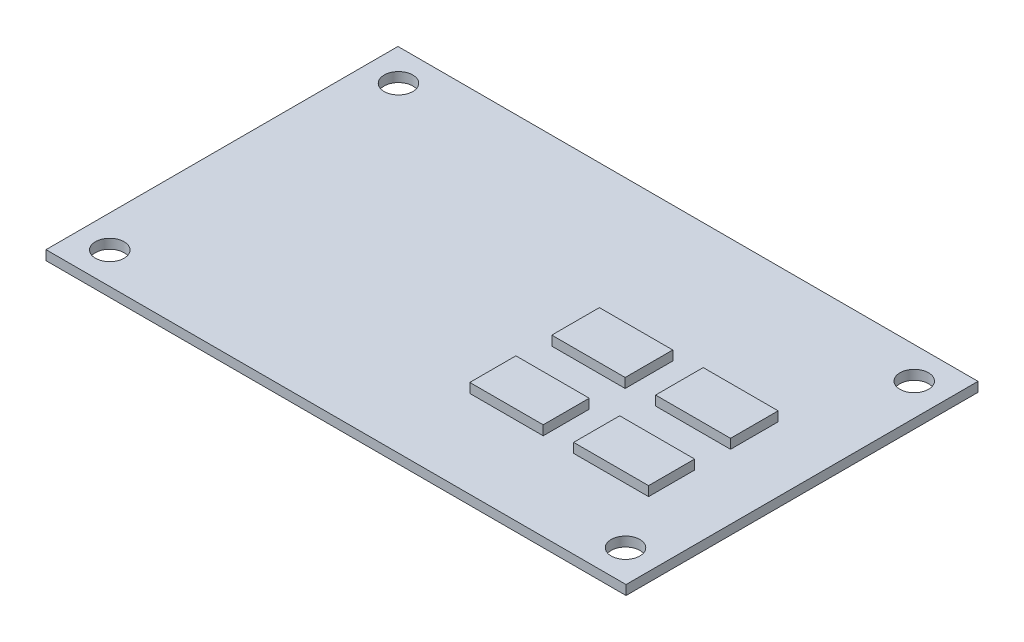
ISO-10303-21;
HEADER;
FILE_DESCRIPTION(('STEP AP214'),'2;1');
FILE_NAME('part.step','',(''),(''),'','','');
FILE_SCHEMA(('AUTOMOTIVE_DESIGN { 1 0 10303 214 1 1 1 1 }'));
ENDSEC;
DATA;
#1=APPLICATION_CONTEXT('core data for automotive mechanical design processes');
#2=APPLICATION_PROTOCOL_DEFINITION('international standard','automotive_design',2000,#1);
#3=PRODUCT_CONTEXT('',#1,'mechanical');
#4=PRODUCT('Part','Part','',(#3));
#5=PRODUCT_RELATED_PRODUCT_CATEGORY('part','',(#4));
#6=PRODUCT_DEFINITION_FORMATION('','',#4);
#7=PRODUCT_DEFINITION_CONTEXT('part definition',#1,'design');
#8=PRODUCT_DEFINITION('design','',#6,#7);
#9=PRODUCT_DEFINITION_SHAPE('','',#8);
#10=(LENGTH_UNIT() NAMED_UNIT(*) SI_UNIT(.MILLI.,.METRE.));
#11=(NAMED_UNIT(*) PLANE_ANGLE_UNIT() SI_UNIT($,.RADIAN.));
#12=(NAMED_UNIT(*) SI_UNIT($,.STERADIAN.) SOLID_ANGLE_UNIT());
#13=UNCERTAINTY_MEASURE_WITH_UNIT(LENGTH_MEASURE(1.E-05),#10,'distance_accuracy_value','');
#14=(GEOMETRIC_REPRESENTATION_CONTEXT(3) GLOBAL_UNCERTAINTY_ASSIGNED_CONTEXT((#13)) GLOBAL_UNIT_ASSIGNED_CONTEXT((#10,
#11,#12)) REPRESENTATION_CONTEXT('',''));
#15=CARTESIAN_POINT('',(0.,0.,0.));
#16=DIRECTION('',(0.,0.,1.));
#17=DIRECTION('',(1.,0.,0.));
#18=AXIS2_PLACEMENT_3D('',#15,#16,#17);
#19=CARTESIAN_POINT('',(0.,1.,0.));
#20=DIRECTION('',(0.,1.,0.));
#21=DIRECTION('',(0.,0.,1.));
#22=AXIS2_PLACEMENT_3D('',#19,#20,#21);
#23=PLANE('',#22);
#24=CARTESIAN_POINT('',(-27.,1.,-15.115));
#25=DIRECTION('',(0.,1.,0.));
#26=DIRECTION('',(0.,0.,1.));
#27=AXIS2_PLACEMENT_3D('',#24,#25,#26);
#28=CIRCLE('',#27,1.5);
#29=CARTESIAN_POINT('',(-27.,1.,-13.615));
#30=VERTEX_POINT('',#29);
#31=EDGE_CURVE('E288',#30,#30,#28,.T.);
#32=ORIENTED_EDGE('',*,*,#31,.F.);
#33=EDGE_LOOP('',(#32));
#34=FACE_BOUND('',#33,.T.);
#35=CARTESIAN_POINT('',(27.,1.,-15.115));
#36=DIRECTION('',(0.,1.,0.));
#37=DIRECTION('',(0.,0.,1.));
#38=AXIS2_PLACEMENT_3D('',#35,#36,#37);
#39=CIRCLE('',#38,1.5);
#40=CARTESIAN_POINT('',(27.,1.,-13.615));
#41=VERTEX_POINT('',#40);
#42=EDGE_CURVE('E291',#41,#41,#39,.T.);
#43=ORIENTED_EDGE('',*,*,#42,.F.);
#44=EDGE_LOOP('',(#43));
#45=FACE_BOUND('',#44,.T.);
#46=CARTESIAN_POINT('',(27.,1.,15.115));
#47=DIRECTION('',(0.,1.,0.));
#48=DIRECTION('',(0.,0.,1.));
#49=AXIS2_PLACEMENT_3D('',#46,#47,#48);
#50=CIRCLE('',#49,1.5);
#51=CARTESIAN_POINT('',(27.,1.,16.615));
#52=VERTEX_POINT('',#51);
#53=EDGE_CURVE('E297',#52,#52,#50,.T.);
#54=ORIENTED_EDGE('',*,*,#53,.F.);
#55=EDGE_LOOP('',(#54));
#56=FACE_BOUND('',#55,.T.);
#57=CARTESIAN_POINT('',(-27.,1.,15.115));
#58=DIRECTION('',(0.,1.,0.));
#59=DIRECTION('',(0.,0.,1.));
#60=AXIS2_PLACEMENT_3D('',#57,#58,#59);
#61=CIRCLE('',#60,1.5);
#62=CARTESIAN_POINT('',(-27.,1.,16.615));
#63=VERTEX_POINT('',#62);
#64=EDGE_CURVE('E301',#63,#63,#61,.T.);
#65=ORIENTED_EDGE('',*,*,#64,.F.);
#66=EDGE_LOOP('',(#65));
#67=FACE_BOUND('',#66,.T.);
#68=DIRECTION('',(0.,0.,-1.));
#69=VECTOR('',#68,1.);
#70=CARTESIAN_POINT('',(30.365,1.,-18.425));
#71=LINE('',#70,#69);
#72=CARTESIAN_POINT('',(30.365,1.,18.425));
#73=VERTEX_POINT('',#72);
#74=CARTESIAN_POINT('',(30.365,1.,-18.425));
#75=VERTEX_POINT('',#74);
#76=EDGE_CURVE('E308',#73,#75,#71,.T.);
#77=ORIENTED_EDGE('',*,*,#76,.T.);
#78=DIRECTION('',(-1.,0.,0.));
#79=VECTOR('',#78,1.);
#80=CARTESIAN_POINT('',(-30.365,1.,-18.425));
#81=LINE('',#80,#79);
#82=CARTESIAN_POINT('',(-30.365,1.,-18.425));
#83=VERTEX_POINT('',#82);
#84=EDGE_CURVE('E311',#75,#83,#81,.T.);
#85=ORIENTED_EDGE('',*,*,#84,.T.);
#86=DIRECTION('',(0.,0.,1.));
#87=VECTOR('',#86,1.);
#88=CARTESIAN_POINT('',(-30.365,1.,-18.425));
#89=LINE('',#88,#87);
#90=CARTESIAN_POINT('',(-30.365,1.,18.425));
#91=VERTEX_POINT('',#90);
#92=EDGE_CURVE('E314',#83,#91,#89,.T.);
#93=ORIENTED_EDGE('',*,*,#92,.T.);
#94=DIRECTION('',(1.,0.,0.));
#95=VECTOR('',#94,1.);
#96=CARTESIAN_POINT('',(-30.365,1.,18.425));
#97=LINE('',#96,#95);
#98=EDGE_CURVE('E316',#91,#73,#97,.T.);
#99=ORIENTED_EDGE('',*,*,#98,.T.);
#100=EDGE_LOOP('',(#77,#85,#93,#99));
#101=FACE_BOUND('',#100,.T.);
#102=DIRECTION('',(1.,0.,0.));
#103=VECTOR('',#102,1.);
#104=CARTESIAN_POINT('',(4.86128004171232,1.,0.69638328456207));
#105=LINE('',#104,#103);
#106=CARTESIAN_POINT('',(4.86128004171232,1.,0.69638328456207));
#107=VERTEX_POINT('',#106);
#108=CARTESIAN_POINT('',(12.5431113991219,1.,0.69638328456207));
#109=VERTEX_POINT('',#108);
#110=EDGE_CURVE('E273',#107,#109,#105,.T.);
#111=ORIENTED_EDGE('',*,*,#110,.F.);
#112=DIRECTION('',(0.,0.,1.));
#113=VECTOR('',#112,1.);
#114=CARTESIAN_POINT('',(4.86128004171232,1.,-4.28863493673567));
#115=LINE('',#114,#113);
#116=CARTESIAN_POINT('',(4.86128004171232,1.,-4.28863493673567));
#117=VERTEX_POINT('',#116);
#118=EDGE_CURVE('E259',#117,#107,#115,.T.);
#119=ORIENTED_EDGE('',*,*,#118,.F.);
#120=DIRECTION('',(-1.,0.,0.));
#121=VECTOR('',#120,1.);
#122=CARTESIAN_POINT('',(4.86128004171232,1.,-4.28863493673567));
#123=LINE('',#122,#121);
#124=CARTESIAN_POINT('',(12.5431113991219,1.,-4.28863493673567));
#125=VERTEX_POINT('',#124);
#126=EDGE_CURVE('E264',#125,#117,#123,.T.);
#127=ORIENTED_EDGE('',*,*,#126,.F.);
#128=DIRECTION('',(0.,0.,-1.));
#129=VECTOR('',#128,1.);
#130=CARTESIAN_POINT('',(12.5431113991219,1.,-4.28863493673567));
#131=LINE('',#130,#129);
#132=EDGE_CURVE('E275',#109,#125,#131,.T.);
#133=ORIENTED_EDGE('',*,*,#132,.F.);
#134=EDGE_LOOP('',(#111,#119,#127,#133));
#135=FACE_BOUND('',#134,.T.);
#136=DIRECTION('',(1.,0.,0.));
#137=VECTOR('',#136,1.);
#138=CARTESIAN_POINT('',(15.7302541963451,1.,0.69638328456207));
#139=LINE('',#138,#137);
#140=CARTESIAN_POINT('',(15.7302541963451,1.,0.69638328456207));
#141=VERTEX_POINT('',#140);
#142=CARTESIAN_POINT('',(23.5755287741251,1.,0.69638328456207));
#143=VERTEX_POINT('',#142);
#144=EDGE_CURVE('E244',#141,#143,#139,.T.);
#145=ORIENTED_EDGE('',*,*,#144,.F.);
#146=DIRECTION('',(0.,0.,1.));
#147=VECTOR('',#146,1.);
#148=CARTESIAN_POINT('',(15.7302541963451,1.,-4.28863493673567));
#149=LINE('',#148,#147);
#150=CARTESIAN_POINT('',(15.7302541963451,1.,-4.28863493673567));
#151=VERTEX_POINT('',#150);
#152=EDGE_CURVE('E230',#151,#141,#149,.T.);
#153=ORIENTED_EDGE('',*,*,#152,.F.);
#154=DIRECTION('',(-1.,0.,0.));
#155=VECTOR('',#154,1.);
#156=CARTESIAN_POINT('',(15.7302541963451,1.,-4.28863493673567));
#157=LINE('',#156,#155);
#158=CARTESIAN_POINT('',(23.5755287741251,1.,-4.28863493673567));
#159=VERTEX_POINT('',#158);
#160=EDGE_CURVE('E235',#159,#151,#157,.T.);
#161=ORIENTED_EDGE('',*,*,#160,.F.);
#162=DIRECTION('',(0.,0.,-1.));
#163=VECTOR('',#162,1.);
#164=CARTESIAN_POINT('',(23.5755287741251,1.,-4.28863493673567));
#165=LINE('',#164,#163);
#166=EDGE_CURVE('E246',#143,#159,#165,.T.);
#167=ORIENTED_EDGE('',*,*,#166,.F.);
#168=EDGE_LOOP('',(#145,#153,#161,#167));
#169=FACE_BOUND('',#168,.T.);
#170=DIRECTION('',(1.,0.,0.));
#171=VECTOR('',#170,1.);
#172=CARTESIAN_POINT('',(4.86128004171232,1.,9.27715235400899));
#173=LINE('',#172,#171);
#174=CARTESIAN_POINT('',(4.86128004171232,1.,9.27715235400899));
#175=VERTEX_POINT('',#174);
#176=CARTESIAN_POINT('',(12.5431113991219,1.,9.27715235400899));
#177=VERTEX_POINT('',#176);
#178=EDGE_CURVE('E202',#175,#177,#173,.T.);
#179=ORIENTED_EDGE('',*,*,#178,.F.);
#180=DIRECTION('',(0.,0.,1.));
#181=VECTOR('',#180,1.);
#182=CARTESIAN_POINT('',(4.86128004171232,1.,4.45557735308167));
#183=LINE('',#182,#181);
#184=CARTESIAN_POINT('',(4.86128004171232,1.,4.45557735308167));
#185=VERTEX_POINT('',#184);
#186=EDGE_CURVE('E199',#185,#175,#183,.T.);
#187=ORIENTED_EDGE('',*,*,#186,.F.);
#188=DIRECTION('',(-1.,0.,0.));
#189=VECTOR('',#188,1.);
#190=CARTESIAN_POINT('',(4.86128004171232,1.,4.45557735308167));
#191=LINE('',#190,#189);
#192=CARTESIAN_POINT('',(12.5431113991219,1.,4.45557735308167));
#193=VERTEX_POINT('',#192);
#194=EDGE_CURVE('E211',#193,#185,#191,.T.);
#195=ORIENTED_EDGE('',*,*,#194,.F.);
#196=DIRECTION('',(0.,0.,-1.));
#197=VECTOR('',#196,1.);
#198=CARTESIAN_POINT('',(12.5431113991219,1.,4.45557735308167));
#199=LINE('',#198,#197);
#200=EDGE_CURVE('E219',#177,#193,#199,.T.);
#201=ORIENTED_EDGE('',*,*,#200,.F.);
#202=EDGE_LOOP('',(#179,#187,#195,#201));
#203=FACE_BOUND('',#202,.T.);
#204=DIRECTION('',(1.,0.,0.));
#205=VECTOR('',#204,1.);
#206=CARTESIAN_POINT('',(15.7302541963451,1.,9.27715235400899));
#207=LINE('',#206,#205);
#208=CARTESIAN_POINT('',(15.7302541963451,1.,9.27715235400899));
#209=VERTEX_POINT('',#208);
#210=CARTESIAN_POINT('',(23.5755287741251,1.,9.27715235400899));
#211=VERTEX_POINT('',#210);
#212=EDGE_CURVE('E404',#209,#211,#207,.T.);
#213=ORIENTED_EDGE('',*,*,#212,.F.);
#214=DIRECTION('',(0.,0.,1.));
#215=VECTOR('',#214,1.);
#216=CARTESIAN_POINT('',(15.7302541963451,1.,4.45557735308167));
#217=LINE('',#216,#215);
#218=CARTESIAN_POINT('',(15.7302541963451,1.,4.45557735308167));
#219=VERTEX_POINT('',#218);
#220=EDGE_CURVE('E197',#219,#209,#217,.T.);
#221=ORIENTED_EDGE('',*,*,#220,.F.);
#222=DIRECTION('',(-1.,0.,0.));
#223=VECTOR('',#222,1.);
#224=CARTESIAN_POINT('',(15.7302541963451,1.,4.45557735308167));
#225=LINE('',#224,#223);
#226=CARTESIAN_POINT('',(23.5755287741251,1.,4.45557735308167));
#227=VERTEX_POINT('',#226);
#228=EDGE_CURVE('E193',#227,#219,#225,.T.);
#229=ORIENTED_EDGE('',*,*,#228,.F.);
#230=DIRECTION('',(0.,0.,-1.));
#231=VECTOR('',#230,1.);
#232=CARTESIAN_POINT('',(23.5755287741251,1.,4.45557735308167));
#233=LINE('',#232,#231);
#234=EDGE_CURVE('E406',#211,#227,#233,.T.);
#235=ORIENTED_EDGE('',*,*,#234,.F.);
#236=EDGE_LOOP('',(#213,#221,#229,#235));
#237=FACE_BOUND('',#236,.T.);
#238=ADVANCED_FACE('F34',(#34,#45,#56,#67,#101,#135,#169,#203,#237),#23,.T.);
#239=CARTESIAN_POINT('',(30.365,1.,-18.425));
#240=DIRECTION('',(-1.,0.,0.));
#241=DIRECTION('',(0.,0.,1.));
#242=AXIS2_PLACEMENT_3D('',#239,#240,#241);
#243=PLANE('',#242);
#244=DIRECTION('',(0.,0.,-1.));
#245=VECTOR('',#244,1.);
#246=CARTESIAN_POINT('',(30.365,0.,-18.425));
#247=LINE('',#246,#245);
#248=CARTESIAN_POINT('',(30.365,0.,18.425));
#249=VERTEX_POINT('',#248);
#250=CARTESIAN_POINT('',(30.365,0.,-18.425));
#251=VERTEX_POINT('',#250);
#252=EDGE_CURVE('E307',#249,#251,#247,.T.);
#253=ORIENTED_EDGE('',*,*,#252,.T.);
#254=DIRECTION('',(0.,-1.,0.));
#255=VECTOR('',#254,1.);
#256=CARTESIAN_POINT('',(30.365,1.,-18.425));
#257=LINE('',#256,#255);
#258=EDGE_CURVE('E11',#75,#251,#257,.T.);
#259=ORIENTED_EDGE('',*,*,#258,.F.);
#260=ORIENTED_EDGE('',*,*,#76,.F.);
#261=DIRECTION('',(0.,-1.,0.));
#262=VECTOR('',#261,1.);
#263=CARTESIAN_POINT('',(30.365,1.,18.425));
#264=LINE('',#263,#262);
#265=EDGE_CURVE('E318',#73,#249,#264,.T.);
#266=ORIENTED_EDGE('',*,*,#265,.T.);
#267=EDGE_LOOP('',(#253,#259,#260,#266));
#268=FACE_BOUND('',#267,.T.);
#269=ADVANCED_FACE('F36',(#268),#243,.F.);
#270=CARTESIAN_POINT('',(-30.365,1.,-18.425));
#271=DIRECTION('',(0.,0.,1.));
#272=DIRECTION('',(1.,0.,0.));
#273=AXIS2_PLACEMENT_3D('',#270,#271,#272);
#274=PLANE('',#273);
#275=DIRECTION('',(-1.,0.,0.));
#276=VECTOR('',#275,1.);
#277=CARTESIAN_POINT('',(-30.365,0.,-18.425));
#278=LINE('',#277,#276);
#279=CARTESIAN_POINT('',(-30.365,0.,-18.425));
#280=VERTEX_POINT('',#279);
#281=EDGE_CURVE('E321',#251,#280,#278,.T.);
#282=ORIENTED_EDGE('',*,*,#281,.T.);
#283=DIRECTION('',(0.,-1.,0.));
#284=VECTOR('',#283,1.);
#285=CARTESIAN_POINT('',(-30.365,1.,-18.425));
#286=LINE('',#285,#284);
#287=EDGE_CURVE('E43',#83,#280,#286,.T.);
#288=ORIENTED_EDGE('',*,*,#287,.F.);
#289=ORIENTED_EDGE('',*,*,#84,.F.);
#290=ORIENTED_EDGE('',*,*,#258,.T.);
#291=EDGE_LOOP('',(#282,#288,#289,#290));
#292=FACE_BOUND('',#291,.T.);
#293=ADVANCED_FACE('F359',(#292),#274,.F.);
#294=CARTESIAN_POINT('',(-30.365,1.,-18.425));
#295=DIRECTION('',(1.,0.,0.));
#296=DIRECTION('',(0.,0.,-1.));
#297=AXIS2_PLACEMENT_3D('',#294,#295,#296);
#298=PLANE('',#297);
#299=DIRECTION('',(0.,0.,1.));
#300=VECTOR('',#299,1.);
#301=CARTESIAN_POINT('',(-30.365,0.,-18.425));
#302=LINE('',#301,#300);
#303=CARTESIAN_POINT('',(-30.365,0.,18.425));
#304=VERTEX_POINT('',#303);
#305=EDGE_CURVE('E323',#280,#304,#302,.T.);
#306=ORIENTED_EDGE('',*,*,#305,.T.);
#307=DIRECTION('',(0.,-1.,0.));
#308=VECTOR('',#307,1.);
#309=CARTESIAN_POINT('',(-30.365,1.,18.425));
#310=LINE('',#309,#308);
#311=EDGE_CURVE('E328',#91,#304,#310,.T.);
#312=ORIENTED_EDGE('',*,*,#311,.F.);
#313=ORIENTED_EDGE('',*,*,#92,.F.);
#314=ORIENTED_EDGE('',*,*,#287,.T.);
#315=EDGE_LOOP('',(#306,#312,#313,#314));
#316=FACE_BOUND('',#315,.T.);
#317=ADVANCED_FACE('F370',(#316),#298,.F.);
#318=CARTESIAN_POINT('',(-30.365,1.,18.425));
#319=DIRECTION('',(0.,0.,-1.));
#320=DIRECTION('',(-1.,0.,0.));
#321=AXIS2_PLACEMENT_3D('',#318,#319,#320);
#322=PLANE('',#321);
#323=DIRECTION('',(1.,0.,0.));
#324=VECTOR('',#323,1.);
#325=CARTESIAN_POINT('',(-30.365,0.,18.425));
#326=LINE('',#325,#324);
#327=EDGE_CURVE('E312',#304,#249,#326,.T.);
#328=ORIENTED_EDGE('',*,*,#327,.T.);
#329=ORIENTED_EDGE('',*,*,#265,.F.);
#330=ORIENTED_EDGE('',*,*,#98,.F.);
#331=ORIENTED_EDGE('',*,*,#311,.T.);
#332=EDGE_LOOP('',(#328,#329,#330,#331));
#333=FACE_BOUND('',#332,.T.);
#334=ADVANCED_FACE('F366',(#333),#322,.F.);
#335=CARTESIAN_POINT('',(0.,0.,0.));
#336=DIRECTION('',(0.,1.,0.));
#337=DIRECTION('',(0.,0.,1.));
#338=AXIS2_PLACEMENT_3D('',#335,#336,#337);
#339=PLANE('',#338);
#340=CARTESIAN_POINT('',(-27.,0.,-15.115));
#341=DIRECTION('',(0.,1.,0.));
#342=DIRECTION('',(0.,0.,1.));
#343=AXIS2_PLACEMENT_3D('',#340,#341,#342);
#344=CIRCLE('',#343,1.5);
#345=CARTESIAN_POINT('',(-27.,0.,-13.615));
#346=VERTEX_POINT('',#345);
#347=EDGE_CURVE('E38',#346,#346,#344,.T.);
#348=ORIENTED_EDGE('',*,*,#347,.T.);
#349=EDGE_LOOP('',(#348));
#350=FACE_BOUND('',#349,.T.);
#351=CARTESIAN_POINT('',(27.,0.,-15.115));
#352=DIRECTION('',(0.,1.,0.));
#353=DIRECTION('',(0.,0.,1.));
#354=AXIS2_PLACEMENT_3D('',#351,#352,#353);
#355=CIRCLE('',#354,1.5);
#356=CARTESIAN_POINT('',(27.,0.,-13.615));
#357=VERTEX_POINT('',#356);
#358=EDGE_CURVE('E294',#357,#357,#355,.T.);
#359=ORIENTED_EDGE('',*,*,#358,.T.);
#360=EDGE_LOOP('',(#359));
#361=FACE_BOUND('',#360,.T.);
#362=CARTESIAN_POINT('',(27.,0.,15.115));
#363=DIRECTION('',(0.,1.,0.));
#364=DIRECTION('',(0.,0.,1.));
#365=AXIS2_PLACEMENT_3D('',#362,#363,#364);
#366=CIRCLE('',#365,1.5);
#367=CARTESIAN_POINT('',(27.,0.,16.615));
#368=VERTEX_POINT('',#367);
#369=EDGE_CURVE('E300',#368,#368,#366,.T.);
#370=ORIENTED_EDGE('',*,*,#369,.T.);
#371=EDGE_LOOP('',(#370));
#372=FACE_BOUND('',#371,.T.);
#373=CARTESIAN_POINT('',(-27.,0.,15.115));
#374=DIRECTION('',(0.,1.,0.));
#375=DIRECTION('',(0.,0.,1.));
#376=AXIS2_PLACEMENT_3D('',#373,#374,#375);
#377=CIRCLE('',#376,1.5);
#378=CARTESIAN_POINT('',(-27.,0.,16.615));
#379=VERTEX_POINT('',#378);
#380=EDGE_CURVE('E304',#379,#379,#377,.T.);
#381=ORIENTED_EDGE('',*,*,#380,.T.);
#382=EDGE_LOOP('',(#381));
#383=FACE_BOUND('',#382,.T.);
#384=ORIENTED_EDGE('',*,*,#252,.F.);
#385=ORIENTED_EDGE('',*,*,#327,.F.);
#386=ORIENTED_EDGE('',*,*,#305,.F.);
#387=ORIENTED_EDGE('',*,*,#281,.F.);
#388=EDGE_LOOP('',(#384,#385,#386,#387));
#389=FACE_BOUND('',#388,.T.);
#390=ADVANCED_FACE('F335',(#350,#361,#372,#383,#389),#339,.F.);
#391=CARTESIAN_POINT('',(-27.,1.,15.115));
#392=DIRECTION('',(0.,1.,0.));
#393=DIRECTION('',(0.,0.,1.));
#394=AXIS2_PLACEMENT_3D('',#391,#392,#393);
#395=CYLINDRICAL_SURFACE('',#394,1.5);
#396=ORIENTED_EDGE('',*,*,#64,.T.);
#397=EDGE_LOOP('',(#396));
#398=FACE_BOUND('',#397,.T.);
#399=ORIENTED_EDGE('',*,*,#380,.F.);
#400=EDGE_LOOP('',(#399));
#401=FACE_BOUND('',#400,.T.);
#402=ADVANCED_FACE('F341',(#398,#401),#395,.F.);
#403=CARTESIAN_POINT('',(27.,1.,15.115));
#404=DIRECTION('',(0.,1.,0.));
#405=DIRECTION('',(0.,0.,1.));
#406=AXIS2_PLACEMENT_3D('',#403,#404,#405);
#407=CYLINDRICAL_SURFACE('',#406,1.5);
#408=ORIENTED_EDGE('',*,*,#53,.T.);
#409=EDGE_LOOP('',(#408));
#410=FACE_BOUND('',#409,.T.);
#411=ORIENTED_EDGE('',*,*,#369,.F.);
#412=EDGE_LOOP('',(#411));
#413=FACE_BOUND('',#412,.T.);
#414=ADVANCED_FACE('F338',(#410,#413),#407,.F.);
#415=CARTESIAN_POINT('',(27.,1.,-15.115));
#416=DIRECTION('',(0.,1.,0.));
#417=DIRECTION('',(0.,0.,1.));
#418=AXIS2_PLACEMENT_3D('',#415,#416,#417);
#419=CYLINDRICAL_SURFACE('',#418,1.5);
#420=ORIENTED_EDGE('',*,*,#42,.T.);
#421=EDGE_LOOP('',(#420));
#422=FACE_BOUND('',#421,.T.);
#423=ORIENTED_EDGE('',*,*,#358,.F.);
#424=EDGE_LOOP('',(#423));
#425=FACE_BOUND('',#424,.T.);
#426=ADVANCED_FACE('F340',(#422,#425),#419,.F.);
#427=CARTESIAN_POINT('',(-27.,1.,-15.115));
#428=DIRECTION('',(0.,1.,0.));
#429=DIRECTION('',(0.,0.,1.));
#430=AXIS2_PLACEMENT_3D('',#427,#428,#429);
#431=CYLINDRICAL_SURFACE('',#430,1.5);
#432=ORIENTED_EDGE('',*,*,#31,.T.);
#433=EDGE_LOOP('',(#432));
#434=FACE_BOUND('',#433,.T.);
#435=ORIENTED_EDGE('',*,*,#347,.F.);
#436=EDGE_LOOP('',(#435));
#437=FACE_BOUND('',#436,.T.);
#438=ADVANCED_FACE('F348',(#434,#437),#431,.F.);
#439=CARTESIAN_POINT('',(4.86128004171232,2.,-4.28863493673567));
#440=DIRECTION('',(1.,0.,0.));
#441=DIRECTION('',(0.,0.,-1.));
#442=AXIS2_PLACEMENT_3D('',#439,#440,#441);
#443=PLANE('',#442);
#444=ORIENTED_EDGE('',*,*,#118,.T.);
#445=DIRECTION('',(0.,-1.,0.));
#446=VECTOR('',#445,1.);
#447=CARTESIAN_POINT('',(4.86128004171232,2.,0.69638328456207));
#448=LINE('',#447,#446);
#449=CARTESIAN_POINT('',(4.86128004171232,2.,0.69638328456207));
#450=VERTEX_POINT('',#449);
#451=EDGE_CURVE('E286',#450,#107,#448,.T.);
#452=ORIENTED_EDGE('',*,*,#451,.F.);
#453=DIRECTION('',(0.,0.,1.));
#454=VECTOR('',#453,1.);
#455=CARTESIAN_POINT('',(4.86128004171232,2.,-4.28863493673567));
#456=LINE('',#455,#454);
#457=CARTESIAN_POINT('',(4.86128004171232,2.,-4.28863493673567));
#458=VERTEX_POINT('',#457);
#459=EDGE_CURVE('E260',#458,#450,#456,.T.);
#460=ORIENTED_EDGE('',*,*,#459,.F.);
#461=DIRECTION('',(0.,-1.,0.));
#462=VECTOR('',#461,1.);
#463=CARTESIAN_POINT('',(4.86128004171232,2.,-4.28863493673567));
#464=LINE('',#463,#462);
#465=EDGE_CURVE('E270',#458,#117,#464,.T.);
#466=ORIENTED_EDGE('',*,*,#465,.T.);
#467=EDGE_LOOP('',(#444,#452,#460,#466));
#468=FACE_BOUND('',#467,.T.);
#469=ADVANCED_FACE('F485',(#468),#443,.F.);
#470=CARTESIAN_POINT('',(4.86128004171232,2.,0.69638328456207));
#471=DIRECTION('',(0.,0.,-1.));
#472=DIRECTION('',(-1.,0.,0.));
#473=AXIS2_PLACEMENT_3D('',#470,#471,#472);
#474=PLANE('',#473);
#475=ORIENTED_EDGE('',*,*,#110,.T.);
#476=DIRECTION('',(0.,-1.,0.));
#477=VECTOR('',#476,1.);
#478=CARTESIAN_POINT('',(12.5431113991219,2.,0.69638328456207));
#479=LINE('',#478,#477);
#480=CARTESIAN_POINT('',(12.5431113991219,2.,0.69638328456207));
#481=VERTEX_POINT('',#480);
#482=EDGE_CURVE('E283',#481,#109,#479,.T.);
#483=ORIENTED_EDGE('',*,*,#482,.F.);
#484=DIRECTION('',(1.,0.,0.));
#485=VECTOR('',#484,1.);
#486=CARTESIAN_POINT('',(4.86128004171232,2.,0.69638328456207));
#487=LINE('',#486,#485);
#488=EDGE_CURVE('E263',#450,#481,#487,.T.);
#489=ORIENTED_EDGE('',*,*,#488,.F.);
#490=ORIENTED_EDGE('',*,*,#451,.T.);
#491=EDGE_LOOP('',(#475,#483,#489,#490));
#492=FACE_BOUND('',#491,.T.);
#493=ADVANCED_FACE('F481',(#492),#474,.F.);
#494=CARTESIAN_POINT('',(12.5431113991219,2.,-4.28863493673567));
#495=DIRECTION('',(-1.,0.,0.));
#496=DIRECTION('',(0.,0.,1.));
#497=AXIS2_PLACEMENT_3D('',#494,#495,#496);
#498=PLANE('',#497);
#499=ORIENTED_EDGE('',*,*,#132,.T.);
#500=DIRECTION('',(0.,-1.,0.));
#501=VECTOR('',#500,1.);
#502=CARTESIAN_POINT('',(12.5431113991219,2.,-4.28863493673567));
#503=LINE('',#502,#501);
#504=CARTESIAN_POINT('',(12.5431113991219,2.,-4.28863493673567));
#505=VERTEX_POINT('',#504);
#506=EDGE_CURVE('E281',#505,#125,#503,.T.);
#507=ORIENTED_EDGE('',*,*,#506,.F.);
#508=DIRECTION('',(0.,0.,-1.));
#509=VECTOR('',#508,1.);
#510=CARTESIAN_POINT('',(12.5431113991219,2.,-4.28863493673567));
#511=LINE('',#510,#509);
#512=EDGE_CURVE('E266',#481,#505,#511,.T.);
#513=ORIENTED_EDGE('',*,*,#512,.F.);
#514=ORIENTED_EDGE('',*,*,#482,.T.);
#515=EDGE_LOOP('',(#499,#507,#513,#514));
#516=FACE_BOUND('',#515,.T.);
#517=ADVANCED_FACE('F477',(#516),#498,.F.);
#518=CARTESIAN_POINT('',(4.86128004171232,2.,-4.28863493673567));
#519=DIRECTION('',(0.,0.,1.));
#520=DIRECTION('',(1.,0.,0.));
#521=AXIS2_PLACEMENT_3D('',#518,#519,#520);
#522=PLANE('',#521);
#523=ORIENTED_EDGE('',*,*,#126,.T.);
#524=ORIENTED_EDGE('',*,*,#465,.F.);
#525=DIRECTION('',(-1.,0.,0.));
#526=VECTOR('',#525,1.);
#527=CARTESIAN_POINT('',(4.86128004171232,2.,-4.28863493673567));
#528=LINE('',#527,#526);
#529=EDGE_CURVE('E268',#505,#458,#528,.T.);
#530=ORIENTED_EDGE('',*,*,#529,.F.);
#531=ORIENTED_EDGE('',*,*,#506,.T.);
#532=EDGE_LOOP('',(#523,#524,#530,#531));
#533=FACE_BOUND('',#532,.T.);
#534=ADVANCED_FACE('F473',(#533),#522,.F.);
#535=CARTESIAN_POINT('',(0.,2.,0.));
#536=DIRECTION('',(0.,1.,0.));
#537=DIRECTION('',(0.,0.,1.));
#538=AXIS2_PLACEMENT_3D('',#535,#536,#537);
#539=PLANE('',#538);
#540=ORIENTED_EDGE('',*,*,#459,.T.);
#541=ORIENTED_EDGE('',*,*,#488,.T.);
#542=ORIENTED_EDGE('',*,*,#512,.T.);
#543=ORIENTED_EDGE('',*,*,#529,.T.);
#544=EDGE_LOOP('',(#540,#541,#542,#543));
#545=FACE_BOUND('',#544,.T.);
#546=ADVANCED_FACE('F469',(#545),#539,.T.);
#547=CARTESIAN_POINT('',(15.7302541963451,2.,-4.28863493673567));
#548=DIRECTION('',(1.,0.,0.));
#549=DIRECTION('',(0.,0.,-1.));
#550=AXIS2_PLACEMENT_3D('',#547,#548,#549);
#551=PLANE('',#550);
#552=ORIENTED_EDGE('',*,*,#152,.T.);
#553=DIRECTION('',(0.,-1.,0.));
#554=VECTOR('',#553,1.);
#555=CARTESIAN_POINT('',(15.7302541963451,2.,0.69638328456207));
#556=LINE('',#555,#554);
#557=CARTESIAN_POINT('',(15.7302541963451,2.,0.69638328456207));
#558=VERTEX_POINT('',#557);
#559=EDGE_CURVE('E257',#558,#141,#556,.T.);
#560=ORIENTED_EDGE('',*,*,#559,.F.);
#561=DIRECTION('',(0.,0.,1.));
#562=VECTOR('',#561,1.);
#563=CARTESIAN_POINT('',(15.7302541963451,2.,-4.28863493673567));
#564=LINE('',#563,#562);
#565=CARTESIAN_POINT('',(15.7302541963451,2.,-4.28863493673567));
#566=VERTEX_POINT('',#565);
#567=EDGE_CURVE('E231',#566,#558,#564,.T.);
#568=ORIENTED_EDGE('',*,*,#567,.F.);
#569=DIRECTION('',(0.,-1.,0.));
#570=VECTOR('',#569,1.);
#571=CARTESIAN_POINT('',(15.7302541963451,2.,-4.28863493673567));
#572=LINE('',#571,#570);
#573=EDGE_CURVE('E241',#566,#151,#572,.T.);
#574=ORIENTED_EDGE('',*,*,#573,.T.);
#575=EDGE_LOOP('',(#552,#560,#568,#574));
#576=FACE_BOUND('',#575,.T.);
#577=ADVANCED_FACE('F465',(#576),#551,.F.);
#578=CARTESIAN_POINT('',(15.7302541963451,2.,0.69638328456207));
#579=DIRECTION('',(0.,0.,-1.));
#580=DIRECTION('',(-1.,0.,0.));
#581=AXIS2_PLACEMENT_3D('',#578,#579,#580);
#582=PLANE('',#581);
#583=ORIENTED_EDGE('',*,*,#144,.T.);
#584=DIRECTION('',(0.,-1.,0.));
#585=VECTOR('',#584,1.);
#586=CARTESIAN_POINT('',(23.5755287741251,2.,0.69638328456207));
#587=LINE('',#586,#585);
#588=CARTESIAN_POINT('',(23.5755287741251,2.,0.69638328456207));
#589=VERTEX_POINT('',#588);
#590=EDGE_CURVE('E254',#589,#143,#587,.T.);
#591=ORIENTED_EDGE('',*,*,#590,.F.);
#592=DIRECTION('',(1.,0.,0.));
#593=VECTOR('',#592,1.);
#594=CARTESIAN_POINT('',(15.7302541963451,2.,0.69638328456207));
#595=LINE('',#594,#593);
#596=EDGE_CURVE('E234',#558,#589,#595,.T.);
#597=ORIENTED_EDGE('',*,*,#596,.F.);
#598=ORIENTED_EDGE('',*,*,#559,.T.);
#599=EDGE_LOOP('',(#583,#591,#597,#598));
#600=FACE_BOUND('',#599,.T.);
#601=ADVANCED_FACE('F461',(#600),#582,.F.);
#602=CARTESIAN_POINT('',(23.5755287741251,2.,-4.28863493673567));
#603=DIRECTION('',(-1.,0.,0.));
#604=DIRECTION('',(0.,0.,1.));
#605=AXIS2_PLACEMENT_3D('',#602,#603,#604);
#606=PLANE('',#605);
#607=ORIENTED_EDGE('',*,*,#166,.T.);
#608=DIRECTION('',(0.,-1.,0.));
#609=VECTOR('',#608,1.);
#610=CARTESIAN_POINT('',(23.5755287741251,2.,-4.28863493673567));
#611=LINE('',#610,#609);
#612=CARTESIAN_POINT('',(23.5755287741251,2.,-4.28863493673567));
#613=VERTEX_POINT('',#612);
#614=EDGE_CURVE('E252',#613,#159,#611,.T.);
#615=ORIENTED_EDGE('',*,*,#614,.F.);
#616=DIRECTION('',(0.,0.,-1.));
#617=VECTOR('',#616,1.);
#618=CARTESIAN_POINT('',(23.5755287741251,2.,-4.28863493673567));
#619=LINE('',#618,#617);
#620=EDGE_CURVE('E237',#589,#613,#619,.T.);
#621=ORIENTED_EDGE('',*,*,#620,.F.);
#622=ORIENTED_EDGE('',*,*,#590,.T.);
#623=EDGE_LOOP('',(#607,#615,#621,#622));
#624=FACE_BOUND('',#623,.T.);
#625=ADVANCED_FACE('F457',(#624),#606,.F.);
#626=CARTESIAN_POINT('',(15.7302541963451,2.,-4.28863493673567));
#627=DIRECTION('',(0.,0.,1.));
#628=DIRECTION('',(1.,0.,0.));
#629=AXIS2_PLACEMENT_3D('',#626,#627,#628);
#630=PLANE('',#629);
#631=ORIENTED_EDGE('',*,*,#160,.T.);
#632=ORIENTED_EDGE('',*,*,#573,.F.);
#633=DIRECTION('',(-1.,0.,0.));
#634=VECTOR('',#633,1.);
#635=CARTESIAN_POINT('',(15.7302541963451,2.,-4.28863493673567));
#636=LINE('',#635,#634);
#637=EDGE_CURVE('E239',#613,#566,#636,.T.);
#638=ORIENTED_EDGE('',*,*,#637,.F.);
#639=ORIENTED_EDGE('',*,*,#614,.T.);
#640=EDGE_LOOP('',(#631,#632,#638,#639));
#641=FACE_BOUND('',#640,.T.);
#642=ADVANCED_FACE('F453',(#641),#630,.F.);
#643=CARTESIAN_POINT('',(0.,2.,0.));
#644=DIRECTION('',(0.,1.,0.));
#645=DIRECTION('',(0.,0.,1.));
#646=AXIS2_PLACEMENT_3D('',#643,#644,#645);
#647=PLANE('',#646);
#648=ORIENTED_EDGE('',*,*,#567,.T.);
#649=ORIENTED_EDGE('',*,*,#596,.T.);
#650=ORIENTED_EDGE('',*,*,#620,.T.);
#651=ORIENTED_EDGE('',*,*,#637,.T.);
#652=EDGE_LOOP('',(#648,#649,#650,#651));
#653=FACE_BOUND('',#652,.T.);
#654=ADVANCED_FACE('F449',(#653),#647,.T.);
#655=CARTESIAN_POINT('',(4.86128004171232,2.,4.45557735308167));
#656=DIRECTION('',(1.,0.,0.));
#657=DIRECTION('',(0.,0.,-1.));
#658=AXIS2_PLACEMENT_3D('',#655,#656,#657);
#659=PLANE('',#658);
#660=ORIENTED_EDGE('',*,*,#186,.T.);
#661=DIRECTION('',(0.,-1.,0.));
#662=VECTOR('',#661,1.);
#663=CARTESIAN_POINT('',(4.86128004171232,2.,9.27715235400899));
#664=LINE('',#663,#662);
#665=CARTESIAN_POINT('',(4.86128004171232,2.,9.27715235400899));
#666=VERTEX_POINT('',#665);
#667=EDGE_CURVE('E228',#666,#175,#664,.T.);
#668=ORIENTED_EDGE('',*,*,#667,.F.);
#669=DIRECTION('',(0.,0.,1.));
#670=VECTOR('',#669,1.);
#671=CARTESIAN_POINT('',(4.86128004171232,2.,4.45557735308167));
#672=LINE('',#671,#670);
#673=CARTESIAN_POINT('',(4.86128004171232,2.,4.45557735308167));
#674=VERTEX_POINT('',#673);
#675=EDGE_CURVE('E207',#674,#666,#672,.T.);
#676=ORIENTED_EDGE('',*,*,#675,.F.);
#677=DIRECTION('',(0.,-1.,0.));
#678=VECTOR('',#677,1.);
#679=CARTESIAN_POINT('',(4.86128004171232,2.,4.45557735308167));
#680=LINE('',#679,#678);
#681=EDGE_CURVE('E216',#674,#185,#680,.T.);
#682=ORIENTED_EDGE('',*,*,#681,.T.);
#683=EDGE_LOOP('',(#660,#668,#676,#682));
#684=FACE_BOUND('',#683,.T.);
#685=ADVANCED_FACE('F445',(#684),#659,.F.);
#686=CARTESIAN_POINT('',(4.86128004171232,2.,9.27715235400899));
#687=DIRECTION('',(0.,0.,-1.));
#688=DIRECTION('',(-1.,0.,0.));
#689=AXIS2_PLACEMENT_3D('',#686,#687,#688);
#690=PLANE('',#689);
#691=ORIENTED_EDGE('',*,*,#178,.T.);
#692=DIRECTION('',(0.,-1.,0.));
#693=VECTOR('',#692,1.);
#694=CARTESIAN_POINT('',(12.5431113991219,2.,9.27715235400899));
#695=LINE('',#694,#693);
#696=CARTESIAN_POINT('',(12.5431113991219,2.,9.27715235400899));
#697=VERTEX_POINT('',#696);
#698=EDGE_CURVE('E225',#697,#177,#695,.T.);
#699=ORIENTED_EDGE('',*,*,#698,.F.);
#700=DIRECTION('',(1.,0.,0.));
#701=VECTOR('',#700,1.);
#702=CARTESIAN_POINT('',(4.86128004171232,2.,9.27715235400899));
#703=LINE('',#702,#701);
#704=EDGE_CURVE('E210',#666,#697,#703,.T.);
#705=ORIENTED_EDGE('',*,*,#704,.F.);
#706=ORIENTED_EDGE('',*,*,#667,.T.);
#707=EDGE_LOOP('',(#691,#699,#705,#706));
#708=FACE_BOUND('',#707,.T.);
#709=ADVANCED_FACE('F441',(#708),#690,.F.);
#710=CARTESIAN_POINT('',(12.5431113991219,2.,4.45557735308167));
#711=DIRECTION('',(-1.,0.,0.));
#712=DIRECTION('',(0.,0.,1.));
#713=AXIS2_PLACEMENT_3D('',#710,#711,#712);
#714=PLANE('',#713);
#715=ORIENTED_EDGE('',*,*,#200,.T.);
#716=DIRECTION('',(0.,-1.,0.));
#717=VECTOR('',#716,1.);
#718=CARTESIAN_POINT('',(12.5431113991219,2.,4.45557735308167));
#719=LINE('',#718,#717);
#720=CARTESIAN_POINT('',(12.5431113991219,2.,4.45557735308167));
#721=VERTEX_POINT('',#720);
#722=EDGE_CURVE('E59',#721,#193,#719,.T.);
#723=ORIENTED_EDGE('',*,*,#722,.F.);
#724=DIRECTION('',(0.,0.,-1.));
#725=VECTOR('',#724,1.);
#726=CARTESIAN_POINT('',(12.5431113991219,2.,4.45557735308167));
#727=LINE('',#726,#725);
#728=EDGE_CURVE('E213',#697,#721,#727,.T.);
#729=ORIENTED_EDGE('',*,*,#728,.F.);
#730=ORIENTED_EDGE('',*,*,#698,.T.);
#731=EDGE_LOOP('',(#715,#723,#729,#730));
#732=FACE_BOUND('',#731,.T.);
#733=ADVANCED_FACE('F438',(#732),#714,.F.);
#734=CARTESIAN_POINT('',(4.86128004171232,2.,4.45557735308167));
#735=DIRECTION('',(0.,0.,1.));
#736=DIRECTION('',(1.,0.,0.));
#737=AXIS2_PLACEMENT_3D('',#734,#735,#736);
#738=PLANE('',#737);
#739=ORIENTED_EDGE('',*,*,#194,.T.);
#740=ORIENTED_EDGE('',*,*,#681,.F.);
#741=DIRECTION('',(-1.,0.,0.));
#742=VECTOR('',#741,1.);
#743=CARTESIAN_POINT('',(4.86128004171232,2.,4.45557735308167));
#744=LINE('',#743,#742);
#745=EDGE_CURVE('E215',#721,#674,#744,.T.);
#746=ORIENTED_EDGE('',*,*,#745,.F.);
#747=ORIENTED_EDGE('',*,*,#722,.T.);
#748=EDGE_LOOP('',(#739,#740,#746,#747));
#749=FACE_BOUND('',#748,.T.);
#750=ADVANCED_FACE('F434',(#749),#738,.F.);
#751=CARTESIAN_POINT('',(0.,2.,0.));
#752=DIRECTION('',(0.,1.,0.));
#753=DIRECTION('',(0.,0.,1.));
#754=AXIS2_PLACEMENT_3D('',#751,#752,#753);
#755=PLANE('',#754);
#756=ORIENTED_EDGE('',*,*,#675,.T.);
#757=ORIENTED_EDGE('',*,*,#704,.T.);
#758=ORIENTED_EDGE('',*,*,#728,.T.);
#759=ORIENTED_EDGE('',*,*,#745,.T.);
#760=EDGE_LOOP('',(#756,#757,#758,#759));
#761=FACE_BOUND('',#760,.T.);
#762=ADVANCED_FACE('F431',(#761),#755,.T.);
#763=CARTESIAN_POINT('',(15.7302541963451,2.,4.45557735308167));
#764=DIRECTION('',(1.,0.,0.));
#765=DIRECTION('',(0.,0.,-1.));
#766=AXIS2_PLACEMENT_3D('',#763,#764,#765);
#767=PLANE('',#766);
#768=ORIENTED_EDGE('',*,*,#220,.T.);
#769=DIRECTION('',(0.,-1.,0.));
#770=VECTOR('',#769,1.);
#771=CARTESIAN_POINT('',(15.7302541963451,2.,9.27715235400899));
#772=LINE('',#771,#770);
#773=CARTESIAN_POINT('',(15.7302541963451,2.,9.27715235400899));
#774=VERTEX_POINT('',#773);
#775=EDGE_CURVE('E178',#774,#209,#772,.T.);
#776=ORIENTED_EDGE('',*,*,#775,.F.);
#777=DIRECTION('',(0.,0.,1.));
#778=VECTOR('',#777,1.);
#779=CARTESIAN_POINT('',(15.7302541963451,2.,4.45557735308167));
#780=LINE('',#779,#778);
#781=CARTESIAN_POINT('',(15.7302541963451,2.,4.45557735308167));
#782=VERTEX_POINT('',#781);
#783=EDGE_CURVE('E185',#782,#774,#780,.T.);
#784=ORIENTED_EDGE('',*,*,#783,.F.);
#785=DIRECTION('',(0.,-1.,0.));
#786=VECTOR('',#785,1.);
#787=CARTESIAN_POINT('',(15.7302541963451,2.,4.45557735308167));
#788=LINE('',#787,#786);
#789=EDGE_CURVE('E413',#782,#219,#788,.T.);
#790=ORIENTED_EDGE('',*,*,#789,.T.);
#791=EDGE_LOOP('',(#768,#776,#784,#790));
#792=FACE_BOUND('',#791,.T.);
#793=ADVANCED_FACE('F195',(#792),#767,.F.);
#794=CARTESIAN_POINT('',(15.7302541963451,2.,9.27715235400899));
#795=DIRECTION('',(0.,0.,-1.));
#796=DIRECTION('',(-1.,0.,0.));
#797=AXIS2_PLACEMENT_3D('',#794,#795,#796);
#798=PLANE('',#797);
#799=ORIENTED_EDGE('',*,*,#212,.T.);
#800=DIRECTION('',(0.,-1.,0.));
#801=VECTOR('',#800,1.);
#802=CARTESIAN_POINT('',(23.5755287741251,2.,9.27715235400899));
#803=LINE('',#802,#801);
#804=CARTESIAN_POINT('',(23.5755287741251,2.,9.27715235400899));
#805=VERTEX_POINT('',#804);
#806=EDGE_CURVE('E181',#805,#211,#803,.T.);
#807=ORIENTED_EDGE('',*,*,#806,.F.);
#808=DIRECTION('',(1.,0.,0.));
#809=VECTOR('',#808,1.);
#810=CARTESIAN_POINT('',(15.7302541963451,2.,9.27715235400899));
#811=LINE('',#810,#809);
#812=EDGE_CURVE('E174',#774,#805,#811,.T.);
#813=ORIENTED_EDGE('',*,*,#812,.F.);
#814=ORIENTED_EDGE('',*,*,#775,.T.);
#815=EDGE_LOOP('',(#799,#807,#813,#814));
#816=FACE_BOUND('',#815,.T.);
#817=ADVANCED_FACE('F176',(#816),#798,.F.);
#818=CARTESIAN_POINT('',(23.5755287741251,2.,4.45557735308167));
#819=DIRECTION('',(-1.,0.,0.));
#820=DIRECTION('',(0.,0.,1.));
#821=AXIS2_PLACEMENT_3D('',#818,#819,#820);
#822=PLANE('',#821);
#823=ORIENTED_EDGE('',*,*,#234,.T.);
#824=DIRECTION('',(0.,-1.,0.));
#825=VECTOR('',#824,1.);
#826=CARTESIAN_POINT('',(23.5755287741251,2.,4.45557735308167));
#827=LINE('',#826,#825);
#828=CARTESIAN_POINT('',(23.5755287741251,2.,4.45557735308167));
#829=VERTEX_POINT('',#828);
#830=EDGE_CURVE('E51',#829,#227,#827,.T.);
#831=ORIENTED_EDGE('',*,*,#830,.F.);
#832=DIRECTION('',(0.,0.,-1.));
#833=VECTOR('',#832,1.);
#834=CARTESIAN_POINT('',(23.5755287741251,2.,4.45557735308167));
#835=LINE('',#834,#833);
#836=EDGE_CURVE('E184',#805,#829,#835,.T.);
#837=ORIENTED_EDGE('',*,*,#836,.F.);
#838=ORIENTED_EDGE('',*,*,#806,.T.);
#839=EDGE_LOOP('',(#823,#831,#837,#838));
#840=FACE_BOUND('',#839,.T.);
#841=ADVANCED_FACE('F416',(#840),#822,.F.);
#842=CARTESIAN_POINT('',(15.7302541963451,2.,4.45557735308167));
#843=DIRECTION('',(0.,0.,1.));
#844=DIRECTION('',(1.,0.,0.));
#845=AXIS2_PLACEMENT_3D('',#842,#843,#844);
#846=PLANE('',#845);
#847=ORIENTED_EDGE('',*,*,#228,.T.);
#848=ORIENTED_EDGE('',*,*,#789,.F.);
#849=DIRECTION('',(-1.,0.,0.));
#850=VECTOR('',#849,1.);
#851=CARTESIAN_POINT('',(15.7302541963451,2.,4.45557735308167));
#852=LINE('',#851,#850);
#853=EDGE_CURVE('E189',#829,#782,#852,.T.);
#854=ORIENTED_EDGE('',*,*,#853,.F.);
#855=ORIENTED_EDGE('',*,*,#830,.T.);
#856=EDGE_LOOP('',(#847,#848,#854,#855));
#857=FACE_BOUND('',#856,.T.);
#858=ADVANCED_FACE('F417',(#857),#846,.F.);
#859=CARTESIAN_POINT('',(0.,2.,0.));
#860=DIRECTION('',(0.,1.,0.));
#861=DIRECTION('',(0.,0.,1.));
#862=AXIS2_PLACEMENT_3D('',#859,#860,#861);
#863=PLANE('',#862);
#864=ORIENTED_EDGE('',*,*,#783,.T.);
#865=ORIENTED_EDGE('',*,*,#812,.T.);
#866=ORIENTED_EDGE('',*,*,#836,.T.);
#867=ORIENTED_EDGE('',*,*,#853,.T.);
#868=EDGE_LOOP('',(#864,#865,#866,#867));
#869=FACE_BOUND('',#868,.T.);
#870=ADVANCED_FACE('F188',(#869),#863,.T.);
#871=CLOSED_SHELL('',(#238,#269,#293,#317,#334,#390,#402,#414,#426,#438,#469,#493,#517,#534,
#546,#577,#601,#625,#642,#654,#685,#709,#733,#750,#762,#793,#817,#841,#858,#870));
#872=MANIFOLD_SOLID_BREP('B2',#871);
#873=ADVANCED_BREP_SHAPE_REPRESENTATION('',(#18,#872),#14);
#874=SHAPE_DEFINITION_REPRESENTATION(#9,#873);
ENDSEC;
END-ISO-10303-21;
